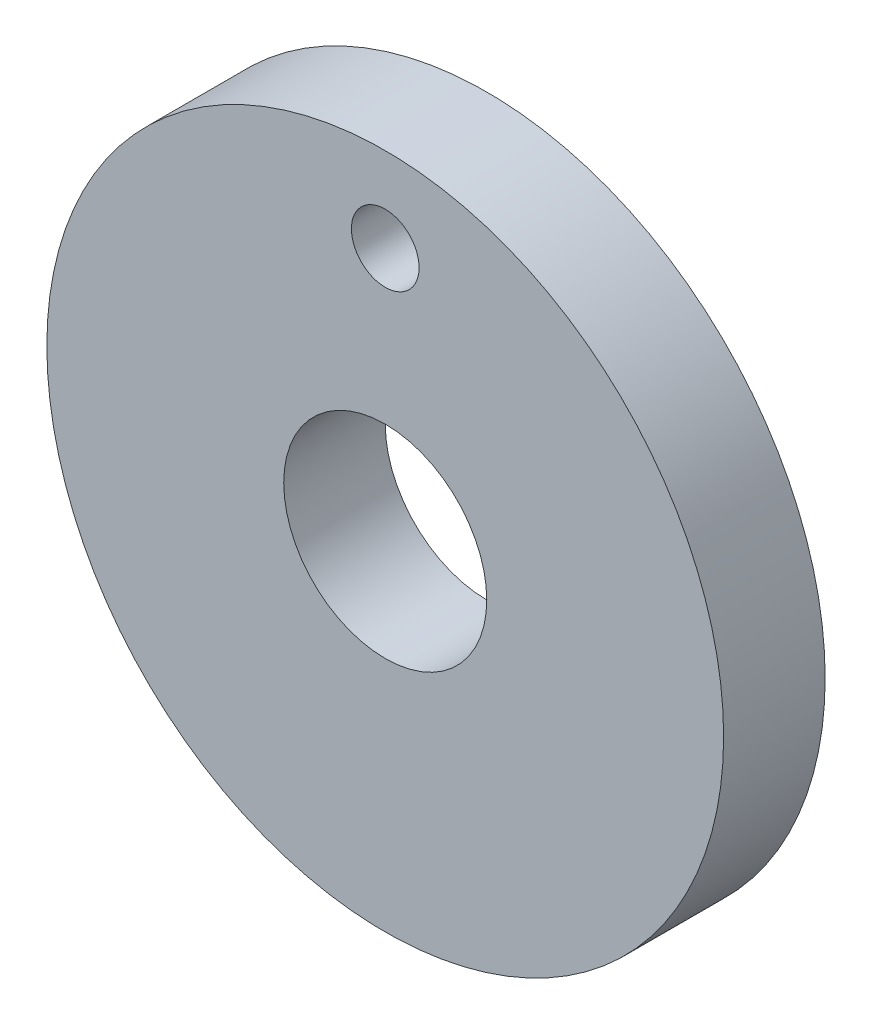
ISO-10303-21;
HEADER;
FILE_DESCRIPTION(('STEP AP214'),'2;1');
FILE_NAME('part.step','',(''),(''),'','','');
FILE_SCHEMA(('AUTOMOTIVE_DESIGN { 1 0 10303 214 1 1 1 1 }'));
ENDSEC;
DATA;
#1=APPLICATION_CONTEXT('core data for automotive mechanical design processes');
#2=APPLICATION_PROTOCOL_DEFINITION('international standard','automotive_design',2000,#1);
#3=PRODUCT_CONTEXT('',#1,'mechanical');
#4=PRODUCT('Part','Part','',(#3));
#5=PRODUCT_RELATED_PRODUCT_CATEGORY('part','',(#4));
#6=PRODUCT_DEFINITION_FORMATION('','',#4);
#7=PRODUCT_DEFINITION_CONTEXT('part definition',#1,'design');
#8=PRODUCT_DEFINITION('design','',#6,#7);
#9=PRODUCT_DEFINITION_SHAPE('','',#8);
#10=(LENGTH_UNIT() NAMED_UNIT(*) SI_UNIT(.MILLI.,.METRE.));
#11=(NAMED_UNIT(*) PLANE_ANGLE_UNIT() SI_UNIT($,.RADIAN.));
#12=(NAMED_UNIT(*) SI_UNIT($,.STERADIAN.) SOLID_ANGLE_UNIT());
#13=UNCERTAINTY_MEASURE_WITH_UNIT(LENGTH_MEASURE(1.E-05),#10,'distance_accuracy_value','');
#14=(GEOMETRIC_REPRESENTATION_CONTEXT(3) GLOBAL_UNCERTAINTY_ASSIGNED_CONTEXT((#13)) GLOBAL_UNIT_ASSIGNED_CONTEXT((#10,
#11,#12)) REPRESENTATION_CONTEXT('',''));
#15=CARTESIAN_POINT('',(0.,0.,0.));
#16=DIRECTION('',(0.,0.,1.));
#17=DIRECTION('',(1.,0.,0.));
#18=AXIS2_PLACEMENT_3D('',#15,#16,#17);
#19=CARTESIAN_POINT('',(0.,0.,3.));
#20=DIRECTION('',(0.,0.,1.));
#21=DIRECTION('',(1.,0.,0.));
#22=AXIS2_PLACEMENT_3D('',#19,#20,#21);
#23=PLANE('',#22);
#24=CARTESIAN_POINT('',(0.,7.5,3.));
#25=DIRECTION('',(0.,0.,1.));
#26=DIRECTION('',(1.,0.,0.));
#27=AXIS2_PLACEMENT_3D('',#24,#25,#26);
#28=CIRCLE('',#27,1.);
#29=CARTESIAN_POINT('',(1.,7.5,3.));
#30=VERTEX_POINT('',#29);
#31=EDGE_CURVE('E46',#30,#30,#28,.T.);
#32=ORIENTED_EDGE('',*,*,#31,.F.);
#33=EDGE_LOOP('',(#32));
#34=FACE_BOUND('',#33,.T.);
#35=CARTESIAN_POINT('',(0.,0.,3.));
#36=DIRECTION('',(0.,0.,1.));
#37=DIRECTION('',(1.,0.,0.));
#38=AXIS2_PLACEMENT_3D('',#35,#36,#37);
#39=CIRCLE('',#38,10.);
#40=CARTESIAN_POINT('',(10.,0.,3.));
#41=VERTEX_POINT('',#40);
#42=EDGE_CURVE('E10',#41,#41,#39,.T.);
#43=ORIENTED_EDGE('',*,*,#42,.T.);
#44=EDGE_LOOP('',(#43));
#45=FACE_BOUND('',#44,.T.);
#46=CARTESIAN_POINT('',(0.,0.,3.));
#47=DIRECTION('',(0.,0.,1.));
#48=DIRECTION('',(1.,0.,0.));
#49=AXIS2_PLACEMENT_3D('',#46,#47,#48);
#50=CIRCLE('',#49,3.);
#51=CARTESIAN_POINT('',(3.,0.,3.));
#52=VERTEX_POINT('',#51);
#53=EDGE_CURVE('E51',#52,#52,#50,.T.);
#54=ORIENTED_EDGE('',*,*,#53,.F.);
#55=EDGE_LOOP('',(#54));
#56=FACE_BOUND('',#55,.T.);
#57=ADVANCED_FACE('F35',(#34,#45,#56),#23,.T.);
#58=CARTESIAN_POINT('',(0.,0.,0.));
#59=DIRECTION('',(0.,0.,1.));
#60=DIRECTION('',(1.,0.,0.));
#61=AXIS2_PLACEMENT_3D('',#58,#59,#60);
#62=PLANE('',#61);
#63=CARTESIAN_POINT('',(0.,0.,0.));
#64=DIRECTION('',(0.,0.,1.));
#65=DIRECTION('',(1.,0.,0.));
#66=AXIS2_PLACEMENT_3D('',#63,#64,#65);
#67=CIRCLE('',#66,10.);
#68=CARTESIAN_POINT('',(10.,0.,0.));
#69=VERTEX_POINT('',#68);
#70=EDGE_CURVE('E39',#69,#69,#67,.T.);
#71=ORIENTED_EDGE('',*,*,#70,.F.);
#72=EDGE_LOOP('',(#71));
#73=FACE_BOUND('',#72,.T.);
#74=CARTESIAN_POINT('',(0.,7.5,0.));
#75=DIRECTION('',(0.,0.,1.));
#76=DIRECTION('',(1.,0.,0.));
#77=AXIS2_PLACEMENT_3D('',#74,#75,#76);
#78=CIRCLE('',#77,1.);
#79=CARTESIAN_POINT('',(1.,7.5,0.));
#80=VERTEX_POINT('',#79);
#81=EDGE_CURVE('E48',#80,#80,#78,.T.);
#82=ORIENTED_EDGE('',*,*,#81,.T.);
#83=EDGE_LOOP('',(#82));
#84=FACE_BOUND('',#83,.T.);
#85=CARTESIAN_POINT('',(0.,0.,0.));
#86=DIRECTION('',(0.,0.,1.));
#87=DIRECTION('',(1.,0.,0.));
#88=AXIS2_PLACEMENT_3D('',#85,#86,#87);
#89=CIRCLE('',#88,3.);
#90=CARTESIAN_POINT('',(3.,0.,0.));
#91=VERTEX_POINT('',#90);
#92=EDGE_CURVE('E54',#91,#91,#89,.T.);
#93=ORIENTED_EDGE('',*,*,#92,.T.);
#94=EDGE_LOOP('',(#93));
#95=FACE_BOUND('',#94,.T.);
#96=ADVANCED_FACE('F64',(#73,#84,#95),#62,.F.);
#97=CARTESIAN_POINT('',(0.,0.,3.));
#98=DIRECTION('',(0.,0.,-1.));
#99=DIRECTION('',(-1.,0.,0.));
#100=AXIS2_PLACEMENT_3D('',#97,#98,#99);
#101=CYLINDRICAL_SURFACE('',#100,10.);
#102=ORIENTED_EDGE('',*,*,#42,.F.);
#103=EDGE_LOOP('',(#102));
#104=FACE_BOUND('',#103,.T.);
#105=ORIENTED_EDGE('',*,*,#70,.T.);
#106=EDGE_LOOP('',(#105));
#107=FACE_BOUND('',#106,.T.);
#108=ADVANCED_FACE('F37',(#104,#107),#101,.T.);
#109=CARTESIAN_POINT('',(0.,7.5,3.));
#110=DIRECTION('',(0.,0.,-1.));
#111=DIRECTION('',(-1.,0.,0.));
#112=AXIS2_PLACEMENT_3D('',#109,#110,#111);
#113=CYLINDRICAL_SURFACE('',#112,1.);
#114=ORIENTED_EDGE('',*,*,#31,.T.);
#115=EDGE_LOOP('',(#114));
#116=FACE_BOUND('',#115,.T.);
#117=ORIENTED_EDGE('',*,*,#81,.F.);
#118=EDGE_LOOP('',(#117));
#119=FACE_BOUND('',#118,.T.);
#120=ADVANCED_FACE('F73',(#116,#119),#113,.F.);
#121=CARTESIAN_POINT('',(0.,0.,3.));
#122=DIRECTION('',(0.,0.,-1.));
#123=DIRECTION('',(-1.,0.,0.));
#124=AXIS2_PLACEMENT_3D('',#121,#122,#123);
#125=CYLINDRICAL_SURFACE('',#124,3.);
#126=ORIENTED_EDGE('',*,*,#53,.T.);
#127=EDGE_LOOP('',(#126));
#128=FACE_BOUND('',#127,.T.);
#129=ORIENTED_EDGE('',*,*,#92,.F.);
#130=EDGE_LOOP('',(#129));
#131=FACE_BOUND('',#130,.T.);
#132=ADVANCED_FACE('F60',(#128,#131),#125,.F.);
#133=CLOSED_SHELL('',(#57,#96,#108,#120,#132));
#134=MANIFOLD_SOLID_BREP('B2',#133);
#135=ADVANCED_BREP_SHAPE_REPRESENTATION('',(#18,#134),#14);
#136=SHAPE_DEFINITION_REPRESENTATION(#9,#135);
ENDSEC;
END-ISO-10303-21;
